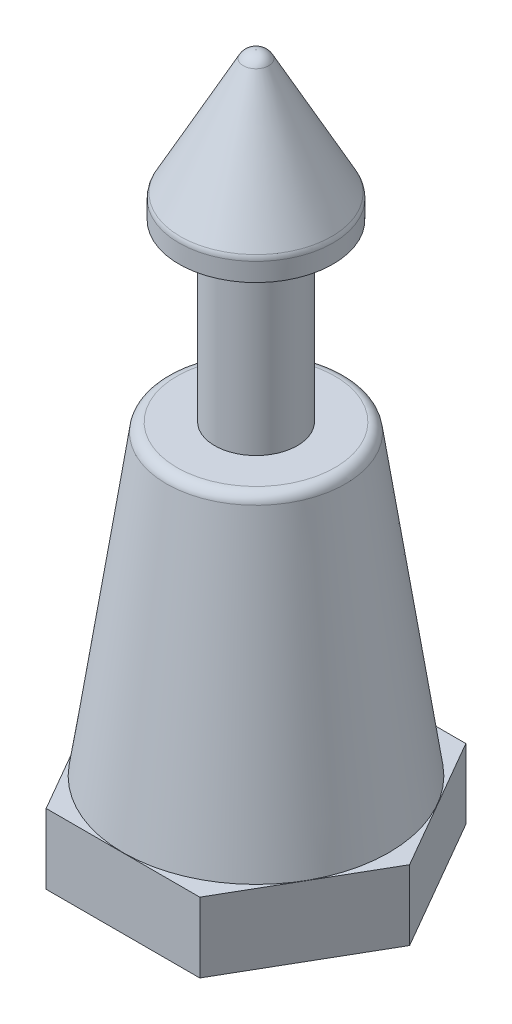
ISO-10303-21;
HEADER;
FILE_DESCRIPTION(('STEP AP214'),'2;1');
FILE_NAME('part.step','',(''),(''),'','','');
FILE_SCHEMA(('AUTOMOTIVE_DESIGN { 1 0 10303 214 1 1 1 1 }'));
ENDSEC;
DATA;
#1=APPLICATION_CONTEXT('core data for automotive mechanical design processes');
#2=APPLICATION_PROTOCOL_DEFINITION('international standard','automotive_design',2000,#1);
#3=PRODUCT_CONTEXT('',#1,'mechanical');
#4=PRODUCT('Part','Part','',(#3));
#5=PRODUCT_RELATED_PRODUCT_CATEGORY('part','',(#4));
#6=PRODUCT_DEFINITION_FORMATION('','',#4);
#7=PRODUCT_DEFINITION_CONTEXT('part definition',#1,'design');
#8=PRODUCT_DEFINITION('design','',#6,#7);
#9=PRODUCT_DEFINITION_SHAPE('','',#8);
#10=(LENGTH_UNIT() NAMED_UNIT(*) SI_UNIT(.MILLI.,.METRE.));
#11=(NAMED_UNIT(*) PLANE_ANGLE_UNIT() SI_UNIT($,.RADIAN.));
#12=(NAMED_UNIT(*) SI_UNIT($,.STERADIAN.) SOLID_ANGLE_UNIT());
#13=UNCERTAINTY_MEASURE_WITH_UNIT(LENGTH_MEASURE(1.E-05),#10,'distance_accuracy_value','');
#14=(GEOMETRIC_REPRESENTATION_CONTEXT(3) GLOBAL_UNCERTAINTY_ASSIGNED_CONTEXT((#13)) GLOBAL_UNIT_ASSIGNED_CONTEXT((#10,
#11,#12)) REPRESENTATION_CONTEXT('',''));
#15=CARTESIAN_POINT('',(0.,0.,0.));
#16=DIRECTION('',(0.,0.,1.));
#17=DIRECTION('',(1.,0.,0.));
#18=AXIS2_PLACEMENT_3D('',#15,#16,#17);
#19=CARTESIAN_POINT('',(0.,2.4892,0.));
#20=DIRECTION('',(0.,-1.,0.));
#21=DIRECTION('',(0.,0.,-1.));
#22=AXIS2_PLACEMENT_3D('',#19,#20,#21);
#23=CONICAL_SURFACE('',#22,4.826,0.144441578374644);
#24=CARTESIAN_POINT('',(0.,13.3390410812171,0.));
#25=DIRECTION('',(0.,1.,0.));
#26=DIRECTION('',(0.,0.,1.));
#27=AXIS2_PLACEMENT_3D('',#24,#25,#26);
#28=CIRCLE('',#27,3.24784129727752);
#29=CARTESIAN_POINT('',(0.,13.3390410812171,3.24784129727752));
#30=VERTEX_POINT('',#29);
#31=EDGE_CURVE('E166',#30,#30,#28,.F.);
#32=ORIENTED_EDGE('',*,*,#31,.T.);
#33=EDGE_LOOP('',(#32));
#34=FACE_BOUND('',#33,.T.);
#35=CARTESIAN_POINT('',(0.,2.54,0.));
#36=DIRECTION('',(0.,-1.,0.));
#37=DIRECTION('',(0.,0.,-1.));
#38=AXIS2_PLACEMENT_3D('',#35,#36,#37);
#39=CIRCLE('',#38,4.81861090909091);
#40=CARTESIAN_POINT('',(0.,2.54,-4.81861090909091));
#41=VERTEX_POINT('',#40);
#42=EDGE_CURVE('E142',#41,#41,#39,.F.);
#43=ORIENTED_EDGE('',*,*,#42,.T.);
#44=EDGE_LOOP('',(#43));
#45=FACE_BOUND('',#44,.T.);
#46=ADVANCED_FACE('F36',(#34,#45),#23,.T.);
#47=CARTESIAN_POINT('',(0.3175,25.3492,0.));
#48=DIRECTION('',(0.,1.,0.));
#49=DIRECTION('',(0.,0.,1.));
#50=AXIS2_PLACEMENT_3D('',#47,#48,#49);
#51=PLANE('',#50);
#52=CARTESIAN_POINT('',(0.,25.3492,0.));
#53=DIRECTION('',(0.,1.,0.));
#54=DIRECTION('',(0.,0.,1.));
#55=AXIS2_PLACEMENT_3D('',#52,#53,#54);
#56=CIRCLE('',#55,0.0149291012925237);
#57=CARTESIAN_POINT('',(0.,25.3492,0.0149291012925237));
#58=VERTEX_POINT('',#57);
#59=EDGE_CURVE('E175',#58,#58,#56,.T.);
#60=ORIENTED_EDGE('',*,*,#59,.T.);
#61=EDGE_LOOP('',(#60));
#62=FACE_BOUND('',#61,.T.);
#63=ADVANCED_FACE('F193',(#62),#51,.T.);
#64=CARTESIAN_POINT('',(0.,20.7772,0.));
#65=DIRECTION('',(0.,-1.,0.));
#66=DIRECTION('',(0.,0.,-1.));
#67=AXIS2_PLACEMENT_3D('',#64,#65,#66);
#68=CONICAL_SURFACE('',#67,2.794,0.496422753404882);
#69=CARTESIAN_POINT('',(0.,25.0831518394587,0.));
#70=DIRECTION('',(0.,1.,0.));
#71=DIRECTION('',(0.,0.,1.));
#72=AXIS2_PLACEMENT_3D('',#69,#70,#71);
#73=CIRCLE('',#72,0.461609420293205);
#74=CARTESIAN_POINT('',(0.,25.0831518394587,0.461609420293205));
#75=VERTEX_POINT('',#74);
#76=EDGE_CURVE('E172',#75,#75,#73,.F.);
#77=ORIENTED_EDGE('',*,*,#76,.T.);
#78=EDGE_LOOP('',(#77));
#79=FACE_BOUND('',#78,.T.);
#80=CARTESIAN_POINT('',(0.,20.8621041736914,0.));
#81=DIRECTION('',(0.,1.,0.));
#82=DIRECTION('',(0.,0.,1.));
#83=AXIS2_PLACEMENT_3D('',#80,#81,#82);
#84=CIRCLE('',#83,2.74801023925051);
#85=CARTESIAN_POINT('',(0.,20.8621041736914,2.74801023925051));
#86=VERTEX_POINT('',#85);
#87=EDGE_CURVE('E163',#86,#86,#84,.T.);
#88=ORIENTED_EDGE('',*,*,#87,.T.);
#89=EDGE_LOOP('',(#88));
#90=FACE_BOUND('',#89,.T.);
#91=ADVANCED_FACE('F199',(#79,#90),#68,.T.);
#92=CARTESIAN_POINT('',(0.,0.,0.));
#93=DIRECTION('',(0.,-1.,0.));
#94=DIRECTION('',(0.,0.,-1.));
#95=AXIS2_PLACEMENT_3D('',#92,#93,#94);
#96=CYLINDRICAL_SURFACE('',#95,2.794);
#97=CARTESIAN_POINT('',(0.,20.6806402940973,0.));
#98=DIRECTION('',(0.,1.,0.));
#99=DIRECTION('',(0.,0.,1.));
#100=AXIS2_PLACEMENT_3D('',#97,#98,#99);
#101=CIRCLE('',#100,2.794);
#102=CARTESIAN_POINT('',(0.,20.6806402940973,2.794));
#103=VERTEX_POINT('',#102);
#104=EDGE_CURVE('E158',#103,#103,#101,.F.);
#105=ORIENTED_EDGE('',*,*,#104,.T.);
#106=EDGE_LOOP('',(#105));
#107=FACE_BOUND('',#106,.T.);
#108=CARTESIAN_POINT('',(0.,20.0152,0.));
#109=DIRECTION('',(0.,-1.,0.));
#110=DIRECTION('',(0.,0.,-1.));
#111=AXIS2_PLACEMENT_3D('',#108,#109,#110);
#112=CIRCLE('',#111,2.794);
#113=CARTESIAN_POINT('',(0.,20.0152,-2.794));
#114=VERTEX_POINT('',#113);
#115=EDGE_CURVE('E155',#114,#114,#112,.T.);
#116=ORIENTED_EDGE('',*,*,#115,.F.);
#117=EDGE_LOOP('',(#116));
#118=FACE_BOUND('',#117,.T.);
#119=ADVANCED_FACE('F218',(#107,#118),#96,.T.);
#120=CARTESIAN_POINT('',(1.4986,20.0152,0.));
#121=DIRECTION('',(0.,-1.,0.));
#122=DIRECTION('',(0.,0.,-1.));
#123=AXIS2_PLACEMENT_3D('',#120,#121,#122);
#124=PLANE('',#123);
#125=ORIENTED_EDGE('',*,*,#115,.T.);
#126=EDGE_LOOP('',(#125));
#127=FACE_BOUND('',#126,.T.);
#128=CARTESIAN_POINT('',(0.,20.0152,0.));
#129=DIRECTION('',(0.,-1.,0.));
#130=DIRECTION('',(0.,0.,-1.));
#131=AXIS2_PLACEMENT_3D('',#128,#129,#130);
#132=CIRCLE('',#131,1.4986);
#133=CARTESIAN_POINT('',(0.,20.0152,-1.4986));
#134=VERTEX_POINT('',#133);
#135=EDGE_CURVE('E152',#134,#134,#132,.T.);
#136=ORIENTED_EDGE('',*,*,#135,.F.);
#137=EDGE_LOOP('',(#136));
#138=FACE_BOUND('',#137,.T.);
#139=ADVANCED_FACE('F214',(#127,#138),#124,.T.);
#140=CARTESIAN_POINT('',(0.,0.,0.));
#141=DIRECTION('',(0.,-1.,0.));
#142=DIRECTION('',(0.,0.,-1.));
#143=AXIS2_PLACEMENT_3D('',#140,#141,#142);
#144=CYLINDRICAL_SURFACE('',#143,1.4986);
#145=ORIENTED_EDGE('',*,*,#135,.T.);
#146=EDGE_LOOP('',(#145));
#147=FACE_BOUND('',#146,.T.);
#148=CARTESIAN_POINT('',(0.,13.6652,0.));
#149=DIRECTION('',(0.,-1.,0.));
#150=DIRECTION('',(0.,0.,-1.));
#151=AXIS2_PLACEMENT_3D('',#148,#149,#150);
#152=CIRCLE('',#151,1.4986);
#153=CARTESIAN_POINT('',(0.,13.6652,-1.4986));
#154=VERTEX_POINT('',#153);
#155=EDGE_CURVE('E149',#154,#154,#152,.T.);
#156=ORIENTED_EDGE('',*,*,#155,.F.);
#157=EDGE_LOOP('',(#156));
#158=FACE_BOUND('',#157,.T.);
#159=ADVANCED_FACE('F210',(#147,#158),#144,.T.);
#160=CARTESIAN_POINT('',(3.2004,13.6652,0.));
#161=DIRECTION('',(0.,1.,0.));
#162=DIRECTION('',(0.,0.,1.));
#163=AXIS2_PLACEMENT_3D('',#160,#161,#162);
#164=PLANE('',#163);
#165=CARTESIAN_POINT('',(0.,13.6652,0.));
#166=DIRECTION('',(0.,1.,0.));
#167=DIRECTION('',(0.,0.,1.));
#168=AXIS2_PLACEMENT_3D('',#165,#166,#167);
#169=CIRCLE('',#168,2.87080886391012);
#170=CARTESIAN_POINT('',(0.,13.6652,2.87080886391012));
#171=VERTEX_POINT('',#170);
#172=EDGE_CURVE('E169',#171,#171,#169,.T.);
#173=ORIENTED_EDGE('',*,*,#172,.T.);
#174=EDGE_LOOP('',(#173));
#175=FACE_BOUND('',#174,.T.);
#176=ORIENTED_EDGE('',*,*,#155,.T.);
#177=EDGE_LOOP('',(#176));
#178=FACE_BOUND('',#177,.T.);
#179=ADVANCED_FACE('F207',(#175,#178),#164,.T.);
#180=CARTESIAN_POINT('',(2.78629239910913,2.54,-4.826));
#181=DIRECTION('',(0.866025403784438,0.,-0.500000000000001));
#182=DIRECTION('',(-0.500000000000001,0.,-0.866025403784438));
#183=AXIS2_PLACEMENT_3D('',#180,#181,#182);
#184=PLANE('',#183);
#185=DIRECTION('',(0.500000000000001,0.,0.866025403784438));
#186=VECTOR('',#185,1.);
#187=CARTESIAN_POINT('',(2.78629239910913,0.,-4.826));
#188=LINE('',#187,#186);
#189=CARTESIAN_POINT('',(2.78629239910913,0.,-4.826));
#190=VERTEX_POINT('',#189);
#191=CARTESIAN_POINT('',(5.57258479821827,0.,0.));
#192=VERTEX_POINT('',#191);
#193=EDGE_CURVE('E127',#190,#192,#188,.T.);
#194=ORIENTED_EDGE('',*,*,#193,.F.);
#195=DIRECTION('',(0.,-1.,0.));
#196=VECTOR('',#195,1.);
#197=CARTESIAN_POINT('',(2.78629239910913,2.54,-4.826));
#198=LINE('',#197,#196);
#199=CARTESIAN_POINT('',(2.78629239910913,2.54,-4.826));
#200=VERTEX_POINT('',#199);
#201=EDGE_CURVE('E53',#200,#190,#198,.T.);
#202=ORIENTED_EDGE('',*,*,#201,.F.);
#203=DIRECTION('',(0.500000000000001,0.,0.866025403784438));
#204=VECTOR('',#203,1.);
#205=CARTESIAN_POINT('',(2.78629239910913,2.54,-4.826));
#206=LINE('',#205,#204);
#207=CARTESIAN_POINT('',(5.57258479821827,2.54,0.));
#208=VERTEX_POINT('',#207);
#209=EDGE_CURVE('E140',#200,#208,#206,.T.);
#210=ORIENTED_EDGE('',*,*,#209,.T.);
#211=DIRECTION('',(0.,-1.,0.));
#212=VECTOR('',#211,1.);
#213=CARTESIAN_POINT('',(5.57258479821827,2.54,0.));
#214=LINE('',#213,#212);
#215=EDGE_CURVE('E88',#208,#192,#214,.T.);
#216=ORIENTED_EDGE('',*,*,#215,.T.);
#217=EDGE_LOOP('',(#194,#202,#210,#216));
#218=FACE_BOUND('',#217,.T.);
#219=ADVANCED_FACE('F205',(#218),#184,.T.);
#220=CARTESIAN_POINT('',(-2.78629239910913,2.54,-4.826));
#221=DIRECTION('',(0.,0.,-1.));
#222=DIRECTION('',(-1.,0.,0.));
#223=AXIS2_PLACEMENT_3D('',#220,#221,#222);
#224=PLANE('',#223);
#225=DIRECTION('',(1.,0.,0.));
#226=VECTOR('',#225,1.);
#227=CARTESIAN_POINT('',(-2.78629239910913,0.,-4.826));
#228=LINE('',#227,#226);
#229=CARTESIAN_POINT('',(-2.78629239910913,0.,-4.826));
#230=VERTEX_POINT('',#229);
#231=EDGE_CURVE('E81',#230,#190,#228,.T.);
#232=ORIENTED_EDGE('',*,*,#231,.F.);
#233=DIRECTION('',(0.,-1.,0.));
#234=VECTOR('',#233,1.);
#235=CARTESIAN_POINT('',(-2.78629239910913,2.54,-4.826));
#236=LINE('',#235,#234);
#237=CARTESIAN_POINT('',(-2.78629239910913,2.54,-4.826));
#238=VERTEX_POINT('',#237);
#239=EDGE_CURVE('E106',#238,#230,#236,.T.);
#240=ORIENTED_EDGE('',*,*,#239,.F.);
#241=DIRECTION('',(1.,0.,0.));
#242=VECTOR('',#241,1.);
#243=CARTESIAN_POINT('',(-2.78629239910913,2.54,-4.826));
#244=LINE('',#243,#242);
#245=EDGE_CURVE('E116',#238,#200,#244,.T.);
#246=ORIENTED_EDGE('',*,*,#245,.T.);
#247=ORIENTED_EDGE('',*,*,#201,.T.);
#248=EDGE_LOOP('',(#232,#240,#246,#247));
#249=FACE_BOUND('',#248,.T.);
#250=ADVANCED_FACE('F265',(#249),#224,.T.);
#251=CARTESIAN_POINT('',(-5.57258479821827,2.54,0.));
#252=DIRECTION('',(-0.866025403784439,0.,-0.5));
#253=DIRECTION('',(-0.5,0.,0.866025403784439));
#254=AXIS2_PLACEMENT_3D('',#251,#252,#253);
#255=PLANE('',#254);
#256=DIRECTION('',(0.5,0.,-0.866025403784439));
#257=VECTOR('',#256,1.);
#258=CARTESIAN_POINT('',(-5.57258479821827,0.,0.));
#259=LINE('',#258,#257);
#260=CARTESIAN_POINT('',(-5.57258479821827,0.,0.));
#261=VERTEX_POINT('',#260);
#262=EDGE_CURVE('E76',#261,#230,#259,.T.);
#263=ORIENTED_EDGE('',*,*,#262,.F.);
#264=DIRECTION('',(0.,-1.,0.));
#265=VECTOR('',#264,1.);
#266=CARTESIAN_POINT('',(-5.57258479821827,2.54,0.));
#267=LINE('',#266,#265);
#268=CARTESIAN_POINT('',(-5.57258479821827,2.54,0.));
#269=VERTEX_POINT('',#268);
#270=EDGE_CURVE('E99',#269,#261,#267,.T.);
#271=ORIENTED_EDGE('',*,*,#270,.F.);
#272=DIRECTION('',(0.5,0.,-0.866025403784439));
#273=VECTOR('',#272,1.);
#274=CARTESIAN_POINT('',(-5.57258479821827,2.54,0.));
#275=LINE('',#274,#273);
#276=EDGE_CURVE('E102',#269,#238,#275,.T.);
#277=ORIENTED_EDGE('',*,*,#276,.T.);
#278=ORIENTED_EDGE('',*,*,#239,.T.);
#279=EDGE_LOOP('',(#263,#271,#277,#278));
#280=FACE_BOUND('',#279,.T.);
#281=ADVANCED_FACE('F101',(#280),#255,.T.);
#282=CARTESIAN_POINT('',(-2.78629239910913,2.54,4.82599999999999));
#283=DIRECTION('',(-0.866025403784438,0.,0.5));
#284=DIRECTION('',(0.5,0.,0.866025403784438));
#285=AXIS2_PLACEMENT_3D('',#282,#283,#284);
#286=PLANE('',#285);
#287=DIRECTION('',(-0.500000000000001,0.,-0.866025403784438));
#288=VECTOR('',#287,1.);
#289=CARTESIAN_POINT('',(-2.78629239910913,0.,4.82599999999999));
#290=LINE('',#289,#288);
#291=CARTESIAN_POINT('',(-2.78629239910913,0.,4.82599999999999));
#292=VERTEX_POINT('',#291);
#293=EDGE_CURVE('E136',#292,#261,#290,.T.);
#294=ORIENTED_EDGE('',*,*,#293,.F.);
#295=DIRECTION('',(0.,-1.,0.));
#296=VECTOR('',#295,1.);
#297=CARTESIAN_POINT('',(-2.78629239910913,2.54,4.82599999999999));
#298=LINE('',#297,#296);
#299=CARTESIAN_POINT('',(-2.78629239910913,2.54,4.82599999999999));
#300=VERTEX_POINT('',#299);
#301=EDGE_CURVE('E107',#300,#292,#298,.T.);
#302=ORIENTED_EDGE('',*,*,#301,.F.);
#303=DIRECTION('',(-0.500000000000001,0.,-0.866025403784438));
#304=VECTOR('',#303,1.);
#305=CARTESIAN_POINT('',(-2.78629239910913,2.54,4.82599999999999));
#306=LINE('',#305,#304);
#307=EDGE_CURVE('E113',#300,#269,#306,.T.);
#308=ORIENTED_EDGE('',*,*,#307,.T.);
#309=ORIENTED_EDGE('',*,*,#270,.T.);
#310=EDGE_LOOP('',(#294,#302,#308,#309));
#311=FACE_BOUND('',#310,.T.);
#312=ADVANCED_FACE('F118',(#311),#286,.T.);
#313=CARTESIAN_POINT('',(2.78629239910914,2.54,4.826));
#314=DIRECTION('',(0.,0.,1.));
#315=DIRECTION('',(1.,0.,0.));
#316=AXIS2_PLACEMENT_3D('',#313,#314,#315);
#317=PLANE('',#316);
#318=DIRECTION('',(-1.,0.,0.));
#319=VECTOR('',#318,1.);
#320=CARTESIAN_POINT('',(2.78629239910914,0.,4.826));
#321=LINE('',#320,#319);
#322=CARTESIAN_POINT('',(2.78629239910914,0.,4.826));
#323=VERTEX_POINT('',#322);
#324=EDGE_CURVE('E133',#323,#292,#321,.T.);
#325=ORIENTED_EDGE('',*,*,#324,.F.);
#326=DIRECTION('',(0.,-1.,0.));
#327=VECTOR('',#326,1.);
#328=CARTESIAN_POINT('',(2.78629239910914,2.54,4.826));
#329=LINE('',#328,#327);
#330=CARTESIAN_POINT('',(2.78629239910914,2.54,4.826));
#331=VERTEX_POINT('',#330);
#332=EDGE_CURVE('E145',#331,#323,#329,.T.);
#333=ORIENTED_EDGE('',*,*,#332,.F.);
#334=DIRECTION('',(-1.,0.,0.));
#335=VECTOR('',#334,1.);
#336=CARTESIAN_POINT('',(2.78629239910914,2.54,4.826));
#337=LINE('',#336,#335);
#338=EDGE_CURVE('E120',#331,#300,#337,.T.);
#339=ORIENTED_EDGE('',*,*,#338,.T.);
#340=ORIENTED_EDGE('',*,*,#301,.T.);
#341=EDGE_LOOP('',(#325,#333,#339,#340));
#342=FACE_BOUND('',#341,.T.);
#343=ADVANCED_FACE('F273',(#342),#317,.T.);
#344=CARTESIAN_POINT('',(5.57258479821827,2.54,0.));
#345=DIRECTION('',(0.866025403784439,0.,0.5));
#346=DIRECTION('',(0.5,0.,-0.866025403784439));
#347=AXIS2_PLACEMENT_3D('',#344,#345,#346);
#348=PLANE('',#347);
#349=DIRECTION('',(-0.5,0.,0.866025403784439));
#350=VECTOR('',#349,1.);
#351=CARTESIAN_POINT('',(5.57258479821827,0.,0.));
#352=LINE('',#351,#350);
#353=EDGE_CURVE('E129',#192,#323,#352,.T.);
#354=ORIENTED_EDGE('',*,*,#353,.F.);
#355=ORIENTED_EDGE('',*,*,#215,.F.);
#356=DIRECTION('',(-0.5,0.,0.866025403784439));
#357=VECTOR('',#356,1.);
#358=CARTESIAN_POINT('',(5.57258479821827,2.54,0.));
#359=LINE('',#358,#357);
#360=EDGE_CURVE('E122',#208,#331,#359,.T.);
#361=ORIENTED_EDGE('',*,*,#360,.T.);
#362=ORIENTED_EDGE('',*,*,#332,.T.);
#363=EDGE_LOOP('',(#354,#355,#361,#362));
#364=FACE_BOUND('',#363,.T.);
#365=ADVANCED_FACE('F263',(#364),#348,.T.);
#366=CARTESIAN_POINT('',(0.,2.54,0.));
#367=DIRECTION('',(0.,-1.,0.));
#368=DIRECTION('',(0.,0.,-1.));
#369=AXIS2_PLACEMENT_3D('',#366,#367,#368);
#370=PLANE('',#369);
#371=ORIENTED_EDGE('',*,*,#42,.F.);
#372=EDGE_LOOP('',(#371));
#373=FACE_BOUND('',#372,.T.);
#374=ORIENTED_EDGE('',*,*,#209,.F.);
#375=ORIENTED_EDGE('',*,*,#245,.F.);
#376=ORIENTED_EDGE('',*,*,#276,.F.);
#377=ORIENTED_EDGE('',*,*,#307,.F.);
#378=ORIENTED_EDGE('',*,*,#338,.F.);
#379=ORIENTED_EDGE('',*,*,#360,.F.);
#380=EDGE_LOOP('',(#374,#375,#376,#377,#378,#379));
#381=FACE_BOUND('',#380,.T.);
#382=ADVANCED_FACE('F111',(#373,#381),#370,.F.);
#383=CARTESIAN_POINT('',(0.,0.,0.));
#384=DIRECTION('',(0.,-1.,0.));
#385=DIRECTION('',(0.,0.,-1.));
#386=AXIS2_PLACEMENT_3D('',#383,#384,#385);
#387=PLANE('',#386);
#388=CARTESIAN_POINT('',(0.,0.,0.));
#389=DIRECTION('',(0.,-1.,0.));
#390=DIRECTION('',(0.,0.,-1.));
#391=AXIS2_PLACEMENT_3D('',#388,#389,#390);
#392=CIRCLE('',#391,2.286);
#393=CARTESIAN_POINT('',(0.,0.,-2.286));
#394=VERTEX_POINT('',#393);
#395=EDGE_CURVE('E11',#394,#394,#392,.F.);
#396=ORIENTED_EDGE('',*,*,#395,.T.);
#397=EDGE_LOOP('',(#396));
#398=FACE_BOUND('',#397,.T.);
#399=ORIENTED_EDGE('',*,*,#293,.T.);
#400=ORIENTED_EDGE('',*,*,#262,.T.);
#401=ORIENTED_EDGE('',*,*,#231,.T.);
#402=ORIENTED_EDGE('',*,*,#193,.T.);
#403=ORIENTED_EDGE('',*,*,#353,.T.);
#404=ORIENTED_EDGE('',*,*,#324,.T.);
#405=EDGE_LOOP('',(#399,#400,#401,#402,#403,#404));
#406=FACE_BOUND('',#405,.T.);
#407=ADVANCED_FACE('F226',(#398,#406),#387,.T.);
#408=CARTESIAN_POINT('',(0.,20.6806402940973,0.));
#409=DIRECTION('',(0.,1.,0.));
#410=DIRECTION('',(0.,0.,1.));
#411=AXIS2_PLACEMENT_3D('',#408,#409,#410);
#412=TOROIDAL_SURFACE('',#411,2.413,0.381);
#413=ORIENTED_EDGE('',*,*,#87,.F.);
#414=EDGE_LOOP('',(#413));
#415=FACE_BOUND('',#414,.T.);
#416=ORIENTED_EDGE('',*,*,#104,.F.);
#417=EDGE_LOOP('',(#416));
#418=FACE_BOUND('',#417,.T.);
#419=ADVANCED_FACE('F229',(#415,#418),#412,.T.);
#420=CARTESIAN_POINT('',(0.,13.2842,0.));
#421=DIRECTION('',(0.,1.,0.));
#422=DIRECTION('',(0.,0.,1.));
#423=AXIS2_PLACEMENT_3D('',#420,#421,#422);
#424=TOROIDAL_SURFACE('',#423,2.87080886391012,0.381);
#425=ORIENTED_EDGE('',*,*,#172,.F.);
#426=EDGE_LOOP('',(#425));
#427=FACE_BOUND('',#426,.T.);
#428=ORIENTED_EDGE('',*,*,#31,.F.);
#429=EDGE_LOOP('',(#428));
#430=FACE_BOUND('',#429,.T.);
#431=ADVANCED_FACE('F233',(#427,#430),#424,.T.);
#432=CARTESIAN_POINT('',(0.,24.8412,0.));
#433=DIRECTION('',(0.,1.,0.));
#434=DIRECTION('',(0.,0.,1.));
#435=AXIS2_PLACEMENT_3D('',#432,#433,#434);
#436=DEGENERATE_TOROIDAL_SURFACE('',#435,0.0149291012925237,0.508,.T.);
#437=ORIENTED_EDGE('',*,*,#59,.F.);
#438=EDGE_LOOP('',(#437));
#439=FACE_BOUND('',#438,.T.);
#440=ORIENTED_EDGE('',*,*,#76,.F.);
#441=EDGE_LOOP('',(#440));
#442=FACE_BOUND('',#441,.T.);
#443=ADVANCED_FACE('F236',(#439,#442),#436,.T.);
#444=CARTESIAN_POINT('',(0.,11.176,0.));
#445=DIRECTION('',(0.,-1.,0.));
#446=DIRECTION('',(0.,0.,-1.));
#447=AXIS2_PLACEMENT_3D('',#444,#445,#446);
#448=CYLINDRICAL_SURFACE('',#447,1.524);
#449=CARTESIAN_POINT('',(0.,0.762000000000002,0.));
#450=DIRECTION('',(0.,-1.,0.));
#451=DIRECTION('',(0.,0.,-1.));
#452=AXIS2_PLACEMENT_3D('',#449,#450,#451);
#453=CIRCLE('',#452,1.524);
#454=CARTESIAN_POINT('',(0.,0.762000000000002,-1.524));
#455=VERTEX_POINT('',#454);
#456=EDGE_CURVE('E45',#455,#455,#453,.T.);
#457=ORIENTED_EDGE('',*,*,#456,.T.);
#458=EDGE_LOOP('',(#457));
#459=FACE_BOUND('',#458,.T.);
#460=CARTESIAN_POINT('',(0.,11.176,0.));
#461=DIRECTION('',(0.,-1.,0.));
#462=DIRECTION('',(0.,0.,-1.));
#463=AXIS2_PLACEMENT_3D('',#460,#461,#462);
#464=CIRCLE('',#463,1.524);
#465=CARTESIAN_POINT('',(0.,11.176,-1.524));
#466=VERTEX_POINT('',#465);
#467=EDGE_CURVE('E130',#466,#466,#464,.T.);
#468=ORIENTED_EDGE('',*,*,#467,.F.);
#469=EDGE_LOOP('',(#468));
#470=FACE_BOUND('',#469,.T.);
#471=ADVANCED_FACE('F180',(#459,#470),#448,.F.);
#472=CARTESIAN_POINT('',(0.,11.176,0.));
#473=DIRECTION('',(0.,-1.,0.));
#474=DIRECTION('',(0.,0.,-1.));
#475=AXIS2_PLACEMENT_3D('',#472,#473,#474);
#476=PLANE('',#475);
#477=ORIENTED_EDGE('',*,*,#467,.T.);
#478=EDGE_LOOP('',(#477));
#479=FACE_BOUND('',#478,.T.);
#480=ADVANCED_FACE('F184',(#479),#476,.T.);
#481=CARTESIAN_POINT('',(0.,0.762000000000002,0.));
#482=DIRECTION('',(0.,-1.,0.));
#483=DIRECTION('',(0.,0.,-1.));
#484=AXIS2_PLACEMENT_3D('',#481,#482,#483);
#485=CONICAL_SURFACE('',#484,1.524,0.785398163397449);
#486=ORIENTED_EDGE('',*,*,#395,.F.);
#487=EDGE_LOOP('',(#486));
#488=FACE_BOUND('',#487,.T.);
#489=ORIENTED_EDGE('',*,*,#456,.F.);
#490=EDGE_LOOP('',(#489));
#491=FACE_BOUND('',#490,.T.);
#492=ADVANCED_FACE('F38',(#488,#491),#485,.F.);
#493=CLOSED_SHELL('',(#46,#63,#91,#119,#139,#159,#179,#219,#250,#281,#312,#343,#365,#382,#407,
#419,#431,#443,#471,#480,#492));
#494=MANIFOLD_SOLID_BREP('B2',#493);
#495=ADVANCED_BREP_SHAPE_REPRESENTATION('',(#18,#494),#14);
#496=SHAPE_DEFINITION_REPRESENTATION(#9,#495);
ENDSEC;
END-ISO-10303-21;
